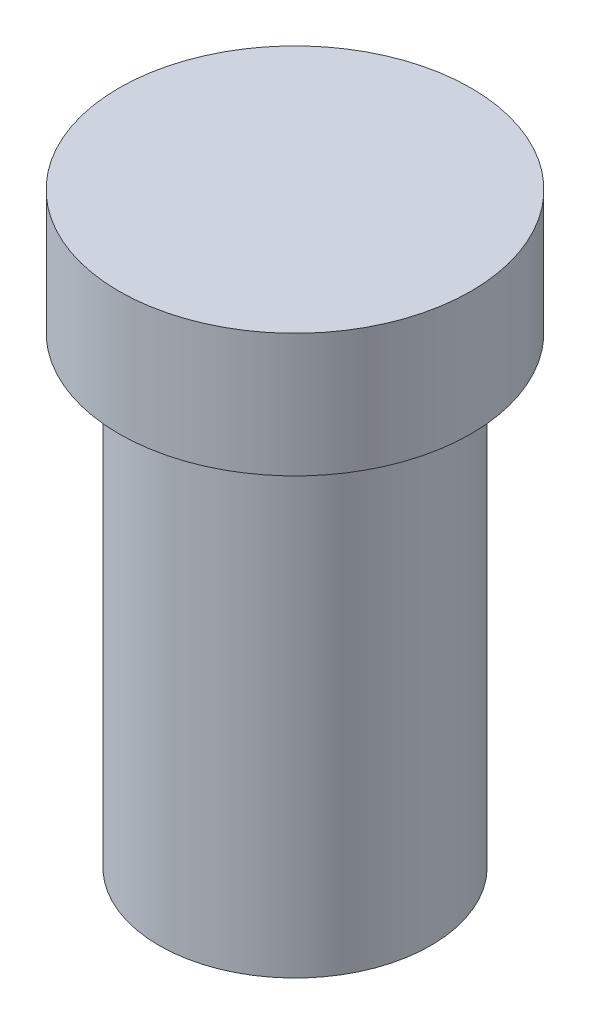
ISO-10303-21;
HEADER;
FILE_DESCRIPTION(('STEP AP214'),'2;1');
FILE_NAME('part.step','',(''),(''),'','','');
FILE_SCHEMA(('AUTOMOTIVE_DESIGN { 1 0 10303 214 1 1 1 1 }'));
ENDSEC;
DATA;
#1=APPLICATION_CONTEXT('core data for automotive mechanical design processes');
#2=APPLICATION_PROTOCOL_DEFINITION('international standard','automotive_design',2000,#1);
#3=PRODUCT_CONTEXT('',#1,'mechanical');
#4=PRODUCT('Part','Part','',(#3));
#5=PRODUCT_RELATED_PRODUCT_CATEGORY('part','',(#4));
#6=PRODUCT_DEFINITION_FORMATION('','',#4);
#7=PRODUCT_DEFINITION_CONTEXT('part definition',#1,'design');
#8=PRODUCT_DEFINITION('design','',#6,#7);
#9=PRODUCT_DEFINITION_SHAPE('','',#8);
#10=(LENGTH_UNIT() NAMED_UNIT(*) SI_UNIT(.MILLI.,.METRE.));
#11=(NAMED_UNIT(*) PLANE_ANGLE_UNIT() SI_UNIT($,.RADIAN.));
#12=(NAMED_UNIT(*) SI_UNIT($,.STERADIAN.) SOLID_ANGLE_UNIT());
#13=UNCERTAINTY_MEASURE_WITH_UNIT(LENGTH_MEASURE(1.E-05),#10,'distance_accuracy_value','');
#14=(GEOMETRIC_REPRESENTATION_CONTEXT(3) GLOBAL_UNCERTAINTY_ASSIGNED_CONTEXT((#13)) GLOBAL_UNIT_ASSIGNED_CONTEXT((#10,
#11,#12)) REPRESENTATION_CONTEXT('',''));
#15=CARTESIAN_POINT('',(0.,0.,0.));
#16=DIRECTION('',(0.,0.,1.));
#17=DIRECTION('',(1.,0.,0.));
#18=AXIS2_PLACEMENT_3D('',#15,#16,#17);
#19=CARTESIAN_POINT('',(0.,75.,0.));
#20=DIRECTION('',(0.,-1.,0.));
#21=DIRECTION('',(0.,0.,-1.));
#22=AXIS2_PLACEMENT_3D('',#19,#20,#21);
#23=CYLINDRICAL_SURFACE('',#22,22.);
#24=CARTESIAN_POINT('',(0.,75.,0.));
#25=DIRECTION('',(0.,1.,0.));
#26=DIRECTION('',(0.,0.,1.));
#27=AXIS2_PLACEMENT_3D('',#24,#25,#26);
#28=CIRCLE('',#27,22.);
#29=CARTESIAN_POINT('',(0.,75.,22.));
#30=VERTEX_POINT('',#29);
#31=EDGE_CURVE('E10',#30,#30,#28,.T.);
#32=ORIENTED_EDGE('',*,*,#31,.F.);
#33=EDGE_LOOP('',(#32));
#34=FACE_BOUND('',#33,.T.);
#35=CARTESIAN_POINT('',(0.,0.,0.));
#36=DIRECTION('',(0.,1.,0.));
#37=DIRECTION('',(0.,0.,1.));
#38=AXIS2_PLACEMENT_3D('',#35,#36,#37);
#39=CIRCLE('',#38,22.);
#40=CARTESIAN_POINT('',(0.,0.,22.));
#41=VERTEX_POINT('',#40);
#42=EDGE_CURVE('E34',#41,#41,#39,.T.);
#43=ORIENTED_EDGE('',*,*,#42,.T.);
#44=EDGE_LOOP('',(#43));
#45=FACE_BOUND('',#44,.T.);
#46=ADVANCED_FACE('F31',(#34,#45),#23,.T.);
#47=CARTESIAN_POINT('',(0.,0.,0.));
#48=DIRECTION('',(0.,1.,0.));
#49=DIRECTION('',(0.,0.,1.));
#50=AXIS2_PLACEMENT_3D('',#47,#48,#49);
#51=PLANE('',#50);
#52=ORIENTED_EDGE('',*,*,#42,.F.);
#53=EDGE_LOOP('',(#52));
#54=FACE_BOUND('',#53,.T.);
#55=ADVANCED_FACE('F54',(#54),#51,.F.);
#56=CARTESIAN_POINT('',(0.,95.,0.));
#57=DIRECTION('',(0.,-1.,0.));
#58=DIRECTION('',(0.,0.,-1.));
#59=AXIS2_PLACEMENT_3D('',#56,#57,#58);
#60=CYLINDRICAL_SURFACE('',#59,28.5);
#61=CARTESIAN_POINT('',(0.,95.,0.));
#62=DIRECTION('',(0.,1.,0.));
#63=DIRECTION('',(0.,0.,1.));
#64=AXIS2_PLACEMENT_3D('',#61,#62,#63);
#65=CIRCLE('',#64,28.5);
#66=CARTESIAN_POINT('',(0.,95.,28.5));
#67=VERTEX_POINT('',#66);
#68=EDGE_CURVE('E41',#67,#67,#65,.T.);
#69=ORIENTED_EDGE('',*,*,#68,.F.);
#70=EDGE_LOOP('',(#69));
#71=FACE_BOUND('',#70,.T.);
#72=CARTESIAN_POINT('',(0.,75.,0.));
#73=DIRECTION('',(0.,1.,0.));
#74=DIRECTION('',(0.,0.,1.));
#75=AXIS2_PLACEMENT_3D('',#72,#73,#74);
#76=CIRCLE('',#75,28.5);
#77=CARTESIAN_POINT('',(0.,75.,28.5));
#78=VERTEX_POINT('',#77);
#79=EDGE_CURVE('E43',#78,#78,#76,.T.);
#80=ORIENTED_EDGE('',*,*,#79,.T.);
#81=EDGE_LOOP('',(#80));
#82=FACE_BOUND('',#81,.T.);
#83=ADVANCED_FACE('F51',(#71,#82),#60,.T.);
#84=CARTESIAN_POINT('',(0.,95.,0.));
#85=DIRECTION('',(0.,1.,0.));
#86=DIRECTION('',(0.,0.,1.));
#87=AXIS2_PLACEMENT_3D('',#84,#85,#86);
#88=PLANE('',#87);
#89=ORIENTED_EDGE('',*,*,#68,.T.);
#90=EDGE_LOOP('',(#89));
#91=FACE_BOUND('',#90,.T.);
#92=ADVANCED_FACE('F49',(#91),#88,.T.);
#93=CARTESIAN_POINT('',(0.,75.,0.));
#94=DIRECTION('',(0.,1.,0.));
#95=DIRECTION('',(0.,0.,1.));
#96=AXIS2_PLACEMENT_3D('',#93,#94,#95);
#97=PLANE('',#96);
#98=ORIENTED_EDGE('',*,*,#31,.T.);
#99=EDGE_LOOP('',(#98));
#100=FACE_BOUND('',#99,.T.);
#101=ORIENTED_EDGE('',*,*,#79,.F.);
#102=EDGE_LOOP('',(#101));
#103=FACE_BOUND('',#102,.T.);
#104=ADVANCED_FACE('F58',(#100,#103),#97,.F.);
#105=CLOSED_SHELL('',(#46,#55,#83,#92,#104));
#106=MANIFOLD_SOLID_BREP('B2',#105);
#107=ADVANCED_BREP_SHAPE_REPRESENTATION('',(#18,#106),#14);
#108=SHAPE_DEFINITION_REPRESENTATION(#9,#107);
ENDSEC;
END-ISO-10303-21;
